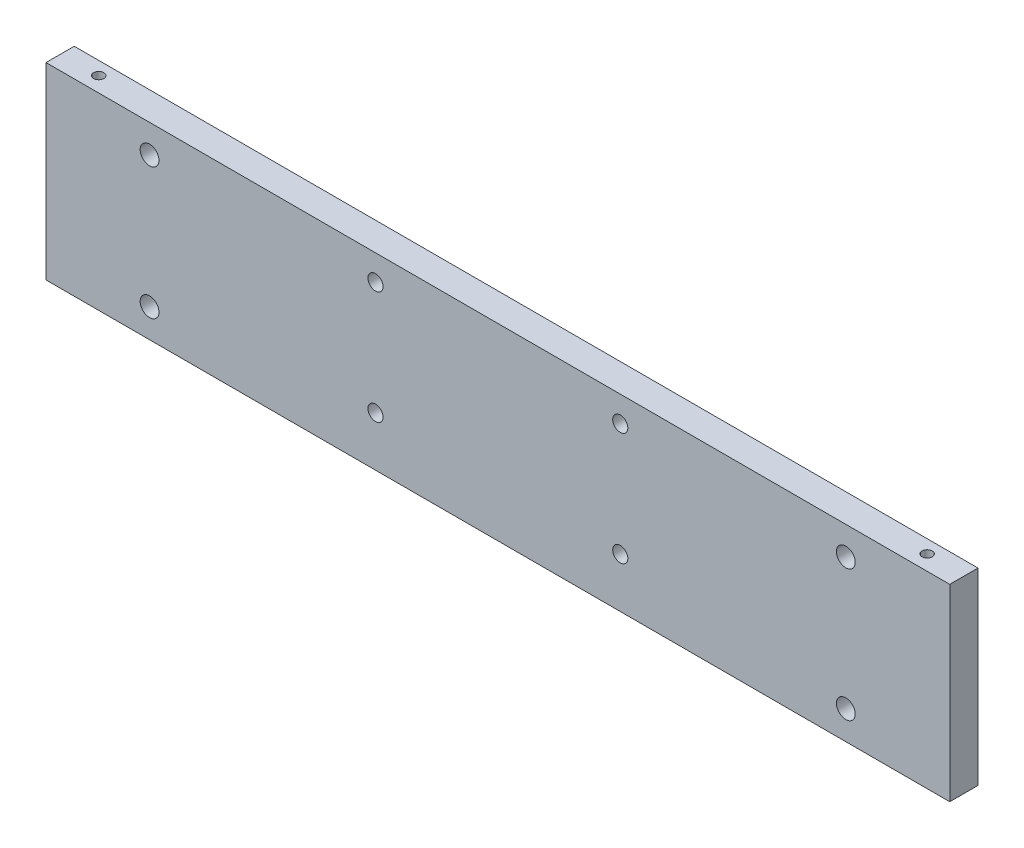
ISO-10303-21;
HEADER;
FILE_DESCRIPTION(('STEP AP214'),'2;1');
FILE_NAME('part.step','',(''),(''),'','','');
FILE_SCHEMA(('AUTOMOTIVE_DESIGN { 1 0 10303 214 1 1 1 1 }'));
ENDSEC;
DATA;
#1=APPLICATION_CONTEXT('core data for automotive mechanical design processes');
#2=APPLICATION_PROTOCOL_DEFINITION('international standard','automotive_design',2000,#1);
#3=PRODUCT_CONTEXT('',#1,'mechanical');
#4=PRODUCT('Part','Part','',(#3));
#5=PRODUCT_RELATED_PRODUCT_CATEGORY('part','',(#4));
#6=PRODUCT_DEFINITION_FORMATION('','',#4);
#7=PRODUCT_DEFINITION_CONTEXT('part definition',#1,'design');
#8=PRODUCT_DEFINITION('design','',#6,#7);
#9=PRODUCT_DEFINITION_SHAPE('','',#8);
#10=(LENGTH_UNIT() NAMED_UNIT(*) SI_UNIT(.MILLI.,.METRE.));
#11=(NAMED_UNIT(*) PLANE_ANGLE_UNIT() SI_UNIT($,.RADIAN.));
#12=(NAMED_UNIT(*) SI_UNIT($,.STERADIAN.) SOLID_ANGLE_UNIT());
#13=UNCERTAINTY_MEASURE_WITH_UNIT(LENGTH_MEASURE(1.E-05),#10,'distance_accuracy_value','');
#14=(GEOMETRIC_REPRESENTATION_CONTEXT(3) GLOBAL_UNCERTAINTY_ASSIGNED_CONTEXT((#13)) GLOBAL_UNIT_ASSIGNED_CONTEXT((#10,
#11,#12)) REPRESENTATION_CONTEXT('',''));
#15=CARTESIAN_POINT('',(0.,0.,0.));
#16=DIRECTION('',(0.,0.,1.));
#17=DIRECTION('',(1.,0.,0.));
#18=AXIS2_PLACEMENT_3D('',#15,#16,#17);
#19=CARTESIAN_POINT('',(152.4,-31.75,9.525));
#20=DIRECTION('',(-1.,0.,0.));
#21=DIRECTION('',(0.,0.,1.));
#22=AXIS2_PLACEMENT_3D('',#19,#20,#21);
#23=PLANE('',#22);
#24=DIRECTION('',(0.,1.,0.));
#25=VECTOR('',#24,1.);
#26=CARTESIAN_POINT('',(152.4,-31.75,0.));
#27=LINE('',#26,#25);
#28=CARTESIAN_POINT('',(152.4,-31.75,0.));
#29=VERTEX_POINT('',#28);
#30=CARTESIAN_POINT('',(152.4,31.75,0.));
#31=VERTEX_POINT('',#30);
#32=EDGE_CURVE('E189',#29,#31,#27,.T.);
#33=ORIENTED_EDGE('',*,*,#32,.T.);
#34=DIRECTION('',(0.,0.,-1.));
#35=VECTOR('',#34,1.);
#36=CARTESIAN_POINT('',(152.4,31.75,9.525));
#37=LINE('',#36,#35);
#38=CARTESIAN_POINT('',(152.4,31.75,9.525));
#39=VERTEX_POINT('',#38);
#40=EDGE_CURVE('E11',#39,#31,#37,.T.);
#41=ORIENTED_EDGE('',*,*,#40,.F.);
#42=DIRECTION('',(0.,1.,0.));
#43=VECTOR('',#42,1.);
#44=CARTESIAN_POINT('',(152.4,-31.75,9.525));
#45=LINE('',#44,#43);
#46=CARTESIAN_POINT('',(152.4,-31.75,9.525));
#47=VERTEX_POINT('',#46);
#48=EDGE_CURVE('E190',#47,#39,#45,.T.);
#49=ORIENTED_EDGE('',*,*,#48,.F.);
#50=DIRECTION('',(0.,0.,-1.));
#51=VECTOR('',#50,1.);
#52=CARTESIAN_POINT('',(152.4,-31.75,9.525));
#53=LINE('',#52,#51);
#54=EDGE_CURVE('E200',#47,#29,#53,.T.);
#55=ORIENTED_EDGE('',*,*,#54,.T.);
#56=EDGE_LOOP('',(#33,#41,#49,#55));
#57=FACE_BOUND('',#56,.T.);
#58=ADVANCED_FACE('F45',(#57),#23,.F.);
#59=CARTESIAN_POINT('',(-152.4,31.75,9.525));
#60=DIRECTION('',(0.,-1.,0.));
#61=DIRECTION('',(0.,0.,-1.));
#62=AXIS2_PLACEMENT_3D('',#59,#60,#61);
#63=PLANE('',#62);
#64=CARTESIAN_POINT('',(-139.7,31.75,4.445));
#65=DIRECTION('',(0.,1.,0.));
#66=DIRECTION('',(0.,0.,1.));
#67=AXIS2_PLACEMENT_3D('',#64,#65,#66);
#68=CIRCLE('',#67,1.72719999999998);
#69=CARTESIAN_POINT('',(-139.7,31.75,6.17219999999998));
#70=VERTEX_POINT('',#69);
#71=EDGE_CURVE('E112',#70,#70,#68,.T.);
#72=ORIENTED_EDGE('',*,*,#71,.F.);
#73=EDGE_LOOP('',(#72));
#74=FACE_BOUND('',#73,.T.);
#75=CARTESIAN_POINT('',(139.7,31.75,4.445));
#76=DIRECTION('',(0.,1.,0.));
#77=DIRECTION('',(0.,0.,1.));
#78=AXIS2_PLACEMENT_3D('',#75,#76,#77);
#79=CIRCLE('',#78,1.72719999999998);
#80=CARTESIAN_POINT('',(139.7,31.75,6.17219999999998));
#81=VERTEX_POINT('',#80);
#82=EDGE_CURVE('E111',#81,#81,#79,.T.);
#83=ORIENTED_EDGE('',*,*,#82,.F.);
#84=EDGE_LOOP('',(#83));
#85=FACE_BOUND('',#84,.T.);
#86=DIRECTION('',(-1.,0.,0.));
#87=VECTOR('',#86,1.);
#88=CARTESIAN_POINT('',(-152.4,31.75,0.));
#89=LINE('',#88,#87);
#90=CARTESIAN_POINT('',(-152.4,31.75,0.));
#91=VERTEX_POINT('',#90);
#92=EDGE_CURVE('E204',#31,#91,#89,.T.);
#93=ORIENTED_EDGE('',*,*,#92,.T.);
#94=DIRECTION('',(0.,0.,-1.));
#95=VECTOR('',#94,1.);
#96=CARTESIAN_POINT('',(-152.4,31.75,9.525));
#97=LINE('',#96,#95);
#98=CARTESIAN_POINT('',(-152.4,31.75,9.525));
#99=VERTEX_POINT('',#98);
#100=EDGE_CURVE('E54',#99,#91,#97,.T.);
#101=ORIENTED_EDGE('',*,*,#100,.F.);
#102=DIRECTION('',(-1.,0.,0.));
#103=VECTOR('',#102,1.);
#104=CARTESIAN_POINT('',(-152.4,31.75,9.525));
#105=LINE('',#104,#103);
#106=EDGE_CURVE('E93',#39,#99,#105,.T.);
#107=ORIENTED_EDGE('',*,*,#106,.F.);
#108=ORIENTED_EDGE('',*,*,#40,.T.);
#109=EDGE_LOOP('',(#93,#101,#107,#108));
#110=FACE_BOUND('',#109,.T.);
#111=ADVANCED_FACE('F234',(#74,#85,#110),#63,.F.);
#112=CARTESIAN_POINT('',(-152.4,-31.75,9.525));
#113=DIRECTION('',(1.,0.,0.));
#114=DIRECTION('',(0.,0.,-1.));
#115=AXIS2_PLACEMENT_3D('',#112,#113,#114);
#116=PLANE('',#115);
#117=DIRECTION('',(0.,-1.,0.));
#118=VECTOR('',#117,1.);
#119=CARTESIAN_POINT('',(-152.4,-31.75,0.));
#120=LINE('',#119,#118);
#121=CARTESIAN_POINT('',(-152.4,-31.75,0.));
#122=VERTEX_POINT('',#121);
#123=EDGE_CURVE('E80',#91,#122,#120,.T.);
#124=ORIENTED_EDGE('',*,*,#123,.T.);
#125=DIRECTION('',(0.,0.,-1.));
#126=VECTOR('',#125,1.);
#127=CARTESIAN_POINT('',(-152.4,-31.75,9.525));
#128=LINE('',#127,#126);
#129=CARTESIAN_POINT('',(-152.4,-31.75,9.525));
#130=VERTEX_POINT('',#129);
#131=EDGE_CURVE('E213',#130,#122,#128,.T.);
#132=ORIENTED_EDGE('',*,*,#131,.F.);
#133=DIRECTION('',(0.,-1.,0.));
#134=VECTOR('',#133,1.);
#135=CARTESIAN_POINT('',(-152.4,-31.75,9.525));
#136=LINE('',#135,#134);
#137=EDGE_CURVE('E195',#99,#130,#136,.T.);
#138=ORIENTED_EDGE('',*,*,#137,.F.);
#139=ORIENTED_EDGE('',*,*,#100,.T.);
#140=EDGE_LOOP('',(#124,#132,#138,#139));
#141=FACE_BOUND('',#140,.T.);
#142=ADVANCED_FACE('F217',(#141),#116,.F.);
#143=CARTESIAN_POINT('',(-152.4,-31.75,9.525));
#144=DIRECTION('',(0.,1.,0.));
#145=DIRECTION('',(0.,0.,1.));
#146=AXIS2_PLACEMENT_3D('',#143,#144,#145);
#147=PLANE('',#146);
#148=DIRECTION('',(1.,0.,0.));
#149=VECTOR('',#148,1.);
#150=CARTESIAN_POINT('',(-152.4,-31.75,0.));
#151=LINE('',#150,#149);
#152=EDGE_CURVE('E86',#122,#29,#151,.T.);
#153=ORIENTED_EDGE('',*,*,#152,.T.);
#154=ORIENTED_EDGE('',*,*,#54,.F.);
#155=DIRECTION('',(1.,0.,0.));
#156=VECTOR('',#155,1.);
#157=CARTESIAN_POINT('',(-152.4,-31.75,9.525));
#158=LINE('',#157,#156);
#159=EDGE_CURVE('E62',#130,#47,#158,.T.);
#160=ORIENTED_EDGE('',*,*,#159,.F.);
#161=ORIENTED_EDGE('',*,*,#131,.T.);
#162=EDGE_LOOP('',(#153,#154,#160,#161));
#163=FACE_BOUND('',#162,.T.);
#164=ADVANCED_FACE('F224',(#163),#147,.F.);
#165=CARTESIAN_POINT('',(0.,0.,9.525));
#166=DIRECTION('',(0.,0.,-1.));
#167=DIRECTION('',(-1.,0.,0.));
#168=AXIS2_PLACEMENT_3D('',#165,#166,#167);
#169=PLANE('',#168);
#170=CARTESIAN_POINT('',(-117.475,22.225,9.525));
#171=DIRECTION('',(0.,0.,1.));
#172=DIRECTION('',(1.,0.,0.));
#173=AXIS2_PLACEMENT_3D('',#170,#171,#172);
#174=CIRCLE('',#173,3.175);
#175=CARTESIAN_POINT('',(-114.3,22.225,9.525));
#176=VERTEX_POINT('',#175);
#177=EDGE_CURVE('E125',#176,#176,#174,.T.);
#178=ORIENTED_EDGE('',*,*,#177,.F.);
#179=EDGE_LOOP('',(#178));
#180=FACE_BOUND('',#179,.T.);
#181=CARTESIAN_POINT('',(-117.475,-22.098,9.525));
#182=DIRECTION('',(0.,0.,1.));
#183=DIRECTION('',(1.,0.,0.));
#184=AXIS2_PLACEMENT_3D('',#181,#182,#183);
#185=CIRCLE('',#184,3.175);
#186=CARTESIAN_POINT('',(-114.3,-22.098,9.525));
#187=VERTEX_POINT('',#186);
#188=EDGE_CURVE('E133',#187,#187,#185,.T.);
#189=ORIENTED_EDGE('',*,*,#188,.F.);
#190=EDGE_LOOP('',(#189));
#191=FACE_BOUND('',#190,.T.);
#192=CARTESIAN_POINT('',(117.348,-22.098,9.525));
#193=DIRECTION('',(0.,0.,1.));
#194=DIRECTION('',(1.,0.,0.));
#195=AXIS2_PLACEMENT_3D('',#192,#193,#194);
#196=CIRCLE('',#195,3.175);
#197=CARTESIAN_POINT('',(120.523,-22.098,9.525));
#198=VERTEX_POINT('',#197);
#199=EDGE_CURVE('E141',#198,#198,#196,.T.);
#200=ORIENTED_EDGE('',*,*,#199,.F.);
#201=EDGE_LOOP('',(#200));
#202=FACE_BOUND('',#201,.T.);
#203=CARTESIAN_POINT('',(117.348,22.225,9.525));
#204=DIRECTION('',(0.,0.,1.));
#205=DIRECTION('',(1.,0.,0.));
#206=AXIS2_PLACEMENT_3D('',#203,#204,#205);
#207=CIRCLE('',#206,3.175);
#208=CARTESIAN_POINT('',(120.523,22.225,9.525));
#209=VERTEX_POINT('',#208);
#210=EDGE_CURVE('E149',#209,#209,#207,.T.);
#211=ORIENTED_EDGE('',*,*,#210,.F.);
#212=EDGE_LOOP('',(#211));
#213=FACE_BOUND('',#212,.T.);
#214=CARTESIAN_POINT('',(-41.275,23.114,9.525));
#215=DIRECTION('',(0.,0.,1.));
#216=DIRECTION('',(1.,0.,0.));
#217=AXIS2_PLACEMENT_3D('',#214,#215,#216);
#218=CIRCLE('',#217,2.5527);
#219=CARTESIAN_POINT('',(-38.7223,23.114,9.525));
#220=VERTEX_POINT('',#219);
#221=EDGE_CURVE('E157',#220,#220,#218,.T.);
#222=ORIENTED_EDGE('',*,*,#221,.F.);
#223=EDGE_LOOP('',(#222));
#224=FACE_BOUND('',#223,.T.);
#225=CARTESIAN_POINT('',(41.275,23.114,9.525));
#226=DIRECTION('',(0.,0.,1.));
#227=DIRECTION('',(1.,0.,0.));
#228=AXIS2_PLACEMENT_3D('',#225,#226,#227);
#229=CIRCLE('',#228,2.5527);
#230=CARTESIAN_POINT('',(43.8277,23.114,9.525));
#231=VERTEX_POINT('',#230);
#232=EDGE_CURVE('E165',#231,#231,#229,.T.);
#233=ORIENTED_EDGE('',*,*,#232,.F.);
#234=EDGE_LOOP('',(#233));
#235=FACE_BOUND('',#234,.T.);
#236=CARTESIAN_POINT('',(41.275,-14.986,9.525));
#237=DIRECTION('',(0.,0.,1.));
#238=DIRECTION('',(1.,0.,0.));
#239=AXIS2_PLACEMENT_3D('',#236,#237,#238);
#240=CIRCLE('',#239,2.5527);
#241=CARTESIAN_POINT('',(43.8277,-14.986,9.525));
#242=VERTEX_POINT('',#241);
#243=EDGE_CURVE('E173',#242,#242,#240,.T.);
#244=ORIENTED_EDGE('',*,*,#243,.F.);
#245=EDGE_LOOP('',(#244));
#246=FACE_BOUND('',#245,.T.);
#247=CARTESIAN_POINT('',(-41.275,-14.986,9.525));
#248=DIRECTION('',(0.,0.,1.));
#249=DIRECTION('',(1.,0.,0.));
#250=AXIS2_PLACEMENT_3D('',#247,#248,#249);
#251=CIRCLE('',#250,2.5527);
#252=CARTESIAN_POINT('',(-38.7223,-14.986,9.525));
#253=VERTEX_POINT('',#252);
#254=EDGE_CURVE('E181',#253,#253,#251,.T.);
#255=ORIENTED_EDGE('',*,*,#254,.F.);
#256=EDGE_LOOP('',(#255));
#257=FACE_BOUND('',#256,.T.);
#258=ORIENTED_EDGE('',*,*,#48,.T.);
#259=ORIENTED_EDGE('',*,*,#106,.T.);
#260=ORIENTED_EDGE('',*,*,#137,.T.);
#261=ORIENTED_EDGE('',*,*,#159,.T.);
#262=EDGE_LOOP('',(#258,#259,#260,#261));
#263=FACE_BOUND('',#262,.T.);
#264=ADVANCED_FACE('F226',(#180,#191,#202,#213,#224,#235,#246,#257,#263),#169,.F.);
#265=CARTESIAN_POINT('',(0.,0.,0.));
#266=DIRECTION('',(0.,0.,-1.));
#267=DIRECTION('',(-1.,0.,0.));
#268=AXIS2_PLACEMENT_3D('',#265,#266,#267);
#269=PLANE('',#268);
#270=CARTESIAN_POINT('',(-117.475,22.225,0.));
#271=DIRECTION('',(0.,0.,1.));
#272=DIRECTION('',(1.,0.,0.));
#273=AXIS2_PLACEMENT_3D('',#270,#271,#272);
#274=CIRCLE('',#273,3.175);
#275=CARTESIAN_POINT('',(-114.3,22.225,0.));
#276=VERTEX_POINT('',#275);
#277=EDGE_CURVE('E129',#276,#276,#274,.T.);
#278=ORIENTED_EDGE('',*,*,#277,.T.);
#279=EDGE_LOOP('',(#278));
#280=FACE_BOUND('',#279,.T.);
#281=CARTESIAN_POINT('',(-117.475,-22.098,0.));
#282=DIRECTION('',(0.,0.,1.));
#283=DIRECTION('',(1.,0.,0.));
#284=AXIS2_PLACEMENT_3D('',#281,#282,#283);
#285=CIRCLE('',#284,3.175);
#286=CARTESIAN_POINT('',(-114.3,-22.098,0.));
#287=VERTEX_POINT('',#286);
#288=EDGE_CURVE('E137',#287,#287,#285,.T.);
#289=ORIENTED_EDGE('',*,*,#288,.T.);
#290=EDGE_LOOP('',(#289));
#291=FACE_BOUND('',#290,.T.);
#292=CARTESIAN_POINT('',(117.348,-22.098,0.));
#293=DIRECTION('',(0.,0.,1.));
#294=DIRECTION('',(1.,0.,0.));
#295=AXIS2_PLACEMENT_3D('',#292,#293,#294);
#296=CIRCLE('',#295,3.175);
#297=CARTESIAN_POINT('',(120.523,-22.098,0.));
#298=VERTEX_POINT('',#297);
#299=EDGE_CURVE('E145',#298,#298,#296,.T.);
#300=ORIENTED_EDGE('',*,*,#299,.T.);
#301=EDGE_LOOP('',(#300));
#302=FACE_BOUND('',#301,.T.);
#303=CARTESIAN_POINT('',(117.348,22.225,0.));
#304=DIRECTION('',(0.,0.,1.));
#305=DIRECTION('',(1.,0.,0.));
#306=AXIS2_PLACEMENT_3D('',#303,#304,#305);
#307=CIRCLE('',#306,3.175);
#308=CARTESIAN_POINT('',(120.523,22.225,0.));
#309=VERTEX_POINT('',#308);
#310=EDGE_CURVE('E153',#309,#309,#307,.T.);
#311=ORIENTED_EDGE('',*,*,#310,.T.);
#312=EDGE_LOOP('',(#311));
#313=FACE_BOUND('',#312,.T.);
#314=CARTESIAN_POINT('',(-41.275,23.114,0.));
#315=DIRECTION('',(0.,0.,1.));
#316=DIRECTION('',(1.,0.,0.));
#317=AXIS2_PLACEMENT_3D('',#314,#315,#316);
#318=CIRCLE('',#317,2.5527);
#319=CARTESIAN_POINT('',(-38.7223,23.114,0.));
#320=VERTEX_POINT('',#319);
#321=EDGE_CURVE('E161',#320,#320,#318,.T.);
#322=ORIENTED_EDGE('',*,*,#321,.T.);
#323=EDGE_LOOP('',(#322));
#324=FACE_BOUND('',#323,.T.);
#325=CARTESIAN_POINT('',(41.275,23.114,0.));
#326=DIRECTION('',(0.,0.,1.));
#327=DIRECTION('',(1.,0.,0.));
#328=AXIS2_PLACEMENT_3D('',#325,#326,#327);
#329=CIRCLE('',#328,2.5527);
#330=CARTESIAN_POINT('',(43.8277,23.114,0.));
#331=VERTEX_POINT('',#330);
#332=EDGE_CURVE('E169',#331,#331,#329,.T.);
#333=ORIENTED_EDGE('',*,*,#332,.T.);
#334=EDGE_LOOP('',(#333));
#335=FACE_BOUND('',#334,.T.);
#336=CARTESIAN_POINT('',(41.275,-14.986,0.));
#337=DIRECTION('',(0.,0.,1.));
#338=DIRECTION('',(1.,0.,0.));
#339=AXIS2_PLACEMENT_3D('',#336,#337,#338);
#340=CIRCLE('',#339,2.5527);
#341=CARTESIAN_POINT('',(43.8277,-14.986,0.));
#342=VERTEX_POINT('',#341);
#343=EDGE_CURVE('E177',#342,#342,#340,.T.);
#344=ORIENTED_EDGE('',*,*,#343,.T.);
#345=EDGE_LOOP('',(#344));
#346=FACE_BOUND('',#345,.T.);
#347=CARTESIAN_POINT('',(-41.275,-14.986,0.));
#348=DIRECTION('',(0.,0.,1.));
#349=DIRECTION('',(1.,0.,0.));
#350=AXIS2_PLACEMENT_3D('',#347,#348,#349);
#351=CIRCLE('',#350,2.5527);
#352=CARTESIAN_POINT('',(-38.7223,-14.986,0.));
#353=VERTEX_POINT('',#352);
#354=EDGE_CURVE('E185',#353,#353,#351,.T.);
#355=ORIENTED_EDGE('',*,*,#354,.T.);
#356=EDGE_LOOP('',(#355));
#357=FACE_BOUND('',#356,.T.);
#358=ORIENTED_EDGE('',*,*,#32,.F.);
#359=ORIENTED_EDGE('',*,*,#152,.F.);
#360=ORIENTED_EDGE('',*,*,#123,.F.);
#361=ORIENTED_EDGE('',*,*,#92,.F.);
#362=EDGE_LOOP('',(#358,#359,#360,#361));
#363=FACE_BOUND('',#362,.T.);
#364=ADVANCED_FACE('F220',(#280,#291,#302,#313,#324,#335,#346,#357,#363),#269,.T.);
#365=CARTESIAN_POINT('',(-41.275,-14.986,9.525));
#366=DIRECTION('',(0.,0.,1.));
#367=DIRECTION('',(1.,0.,0.));
#368=AXIS2_PLACEMENT_3D('',#365,#366,#367);
#369=CYLINDRICAL_SURFACE('',#368,2.5527);
#370=ORIENTED_EDGE('',*,*,#354,.F.);
#371=EDGE_LOOP('',(#370));
#372=FACE_BOUND('',#371,.T.);
#373=ORIENTED_EDGE('',*,*,#254,.T.);
#374=EDGE_LOOP('',(#373));
#375=FACE_BOUND('',#374,.T.);
#376=ADVANCED_FACE('F287',(#372,#375),#369,.F.);
#377=CARTESIAN_POINT('',(41.275,-14.986,9.525));
#378=DIRECTION('',(0.,0.,1.));
#379=DIRECTION('',(1.,0.,0.));
#380=AXIS2_PLACEMENT_3D('',#377,#378,#379);
#381=CYLINDRICAL_SURFACE('',#380,2.5527);
#382=ORIENTED_EDGE('',*,*,#343,.F.);
#383=EDGE_LOOP('',(#382));
#384=FACE_BOUND('',#383,.T.);
#385=ORIENTED_EDGE('',*,*,#243,.T.);
#386=EDGE_LOOP('',(#385));
#387=FACE_BOUND('',#386,.T.);
#388=ADVANCED_FACE('F283',(#384,#387),#381,.F.);
#389=CARTESIAN_POINT('',(41.275,23.114,9.525));
#390=DIRECTION('',(0.,0.,1.));
#391=DIRECTION('',(1.,0.,0.));
#392=AXIS2_PLACEMENT_3D('',#389,#390,#391);
#393=CYLINDRICAL_SURFACE('',#392,2.5527);
#394=ORIENTED_EDGE('',*,*,#332,.F.);
#395=EDGE_LOOP('',(#394));
#396=FACE_BOUND('',#395,.T.);
#397=ORIENTED_EDGE('',*,*,#232,.T.);
#398=EDGE_LOOP('',(#397));
#399=FACE_BOUND('',#398,.T.);
#400=ADVANCED_FACE('F279',(#396,#399),#393,.F.);
#401=CARTESIAN_POINT('',(-41.275,23.114,9.525));
#402=DIRECTION('',(0.,0.,1.));
#403=DIRECTION('',(1.,0.,0.));
#404=AXIS2_PLACEMENT_3D('',#401,#402,#403);
#405=CYLINDRICAL_SURFACE('',#404,2.5527);
#406=ORIENTED_EDGE('',*,*,#321,.F.);
#407=EDGE_LOOP('',(#406));
#408=FACE_BOUND('',#407,.T.);
#409=ORIENTED_EDGE('',*,*,#221,.T.);
#410=EDGE_LOOP('',(#409));
#411=FACE_BOUND('',#410,.T.);
#412=ADVANCED_FACE('F275',(#408,#411),#405,.F.);
#413=CARTESIAN_POINT('',(117.348,22.225,9.525));
#414=DIRECTION('',(0.,0.,1.));
#415=DIRECTION('',(1.,0.,0.));
#416=AXIS2_PLACEMENT_3D('',#413,#414,#415);
#417=CYLINDRICAL_SURFACE('',#416,3.175);
#418=ORIENTED_EDGE('',*,*,#310,.F.);
#419=EDGE_LOOP('',(#418));
#420=FACE_BOUND('',#419,.T.);
#421=ORIENTED_EDGE('',*,*,#210,.T.);
#422=EDGE_LOOP('',(#421));
#423=FACE_BOUND('',#422,.T.);
#424=ADVANCED_FACE('F271',(#420,#423),#417,.F.);
#425=CARTESIAN_POINT('',(117.348,-22.098,9.525));
#426=DIRECTION('',(0.,0.,1.));
#427=DIRECTION('',(1.,0.,0.));
#428=AXIS2_PLACEMENT_3D('',#425,#426,#427);
#429=CYLINDRICAL_SURFACE('',#428,3.175);
#430=ORIENTED_EDGE('',*,*,#299,.F.);
#431=EDGE_LOOP('',(#430));
#432=FACE_BOUND('',#431,.T.);
#433=ORIENTED_EDGE('',*,*,#199,.T.);
#434=EDGE_LOOP('',(#433));
#435=FACE_BOUND('',#434,.T.);
#436=ADVANCED_FACE('F267',(#432,#435),#429,.F.);
#437=CARTESIAN_POINT('',(-117.475,-22.098,9.525));
#438=DIRECTION('',(0.,0.,1.));
#439=DIRECTION('',(1.,0.,0.));
#440=AXIS2_PLACEMENT_3D('',#437,#438,#439);
#441=CYLINDRICAL_SURFACE('',#440,3.175);
#442=ORIENTED_EDGE('',*,*,#288,.F.);
#443=EDGE_LOOP('',(#442));
#444=FACE_BOUND('',#443,.T.);
#445=ORIENTED_EDGE('',*,*,#188,.T.);
#446=EDGE_LOOP('',(#445));
#447=FACE_BOUND('',#446,.T.);
#448=ADVANCED_FACE('F263',(#444,#447),#441,.F.);
#449=CARTESIAN_POINT('',(-117.475,22.225,9.525));
#450=DIRECTION('',(0.,0.,1.));
#451=DIRECTION('',(1.,0.,0.));
#452=AXIS2_PLACEMENT_3D('',#449,#450,#451);
#453=CYLINDRICAL_SURFACE('',#452,3.175);
#454=ORIENTED_EDGE('',*,*,#277,.F.);
#455=EDGE_LOOP('',(#454));
#456=FACE_BOUND('',#455,.T.);
#457=ORIENTED_EDGE('',*,*,#177,.T.);
#458=EDGE_LOOP('',(#457));
#459=FACE_BOUND('',#458,.T.);
#460=ADVANCED_FACE('F255',(#456,#459),#453,.F.);
#461=CARTESIAN_POINT('',(139.7,16.764,4.445));
#462=DIRECTION('',(0.,1.,0.));
#463=DIRECTION('',(0.,0.,1.));
#464=AXIS2_PLACEMENT_3D('',#461,#462,#463);
#465=CONICAL_SURFACE('',#464,1.72719999999998,1.02974425867665);
#466=CARTESIAN_POINT('',(139.7,15.7261935388156,4.445));
#467=VERTEX_POINT('',#466);
#468=VERTEX_LOOP('',#467);
#469=FACE_BOUND('',#468,.T.);
#470=CARTESIAN_POINT('',(139.7,16.764,4.445));
#471=DIRECTION('',(0.,1.,0.));
#472=DIRECTION('',(0.,0.,1.));
#473=AXIS2_PLACEMENT_3D('',#470,#471,#472);
#474=CIRCLE('',#473,1.72719999999998);
#475=CARTESIAN_POINT('',(139.7,16.764,6.17219999999998));
#476=VERTEX_POINT('',#475);
#477=EDGE_CURVE('E117',#476,#476,#474,.T.);
#478=ORIENTED_EDGE('',*,*,#477,.T.);
#479=EDGE_LOOP('',(#478));
#480=FACE_BOUND('',#479,.T.);
#481=ADVANCED_FACE('F249',(#469,#480),#465,.F.);
#482=CARTESIAN_POINT('',(139.7,31.75,4.445));
#483=DIRECTION('',(0.,1.,0.));
#484=DIRECTION('',(0.,0.,1.));
#485=AXIS2_PLACEMENT_3D('',#482,#483,#484);
#486=CYLINDRICAL_SURFACE('',#485,1.72719999999998);
#487=ORIENTED_EDGE('',*,*,#477,.F.);
#488=EDGE_LOOP('',(#487));
#489=FACE_BOUND('',#488,.T.);
#490=ORIENTED_EDGE('',*,*,#82,.T.);
#491=EDGE_LOOP('',(#490));
#492=FACE_BOUND('',#491,.T.);
#493=ADVANCED_FACE('F104',(#489,#492),#486,.F.);
#494=CARTESIAN_POINT('',(-139.7,16.764,4.445));
#495=DIRECTION('',(0.,1.,0.));
#496=DIRECTION('',(0.,0.,1.));
#497=AXIS2_PLACEMENT_3D('',#494,#495,#496);
#498=CONICAL_SURFACE('',#497,1.72719999999998,1.02974425867665);
#499=CARTESIAN_POINT('',(-139.7,15.7261935388156,4.445));
#500=VERTEX_POINT('',#499);
#501=VERTEX_LOOP('',#500);
#502=FACE_BOUND('',#501,.T.);
#503=CARTESIAN_POINT('',(-139.7,16.764,4.445));
#504=DIRECTION('',(0.,1.,0.));
#505=DIRECTION('',(0.,0.,1.));
#506=AXIS2_PLACEMENT_3D('',#503,#504,#505);
#507=CIRCLE('',#506,1.72719999999998);
#508=CARTESIAN_POINT('',(-139.7,16.764,6.17219999999998));
#509=VERTEX_POINT('',#508);
#510=EDGE_CURVE('E108',#509,#509,#507,.T.);
#511=ORIENTED_EDGE('',*,*,#510,.T.);
#512=EDGE_LOOP('',(#511));
#513=FACE_BOUND('',#512,.T.);
#514=ADVANCED_FACE('F100',(#502,#513),#498,.F.);
#515=CARTESIAN_POINT('',(-139.7,31.75,4.445));
#516=DIRECTION('',(0.,1.,0.));
#517=DIRECTION('',(0.,0.,1.));
#518=AXIS2_PLACEMENT_3D('',#515,#516,#517);
#519=CYLINDRICAL_SURFACE('',#518,1.72719999999998);
#520=ORIENTED_EDGE('',*,*,#510,.F.);
#521=EDGE_LOOP('',(#520));
#522=FACE_BOUND('',#521,.T.);
#523=ORIENTED_EDGE('',*,*,#71,.T.);
#524=EDGE_LOOP('',(#523));
#525=FACE_BOUND('',#524,.T.);
#526=ADVANCED_FACE('F103',(#522,#525),#519,.F.);
#527=CLOSED_SHELL('',(#58,#111,#142,#164,#264,#364,#376,#388,#400,#412,#424,#436,#448,#460,#481,
#493,#514,#526));
#528=MANIFOLD_SOLID_BREP('B2',#527);
#529=ADVANCED_BREP_SHAPE_REPRESENTATION('',(#18,#528),#14);
#530=SHAPE_DEFINITION_REPRESENTATION(#9,#529);
ENDSEC;
END-ISO-10303-21;
